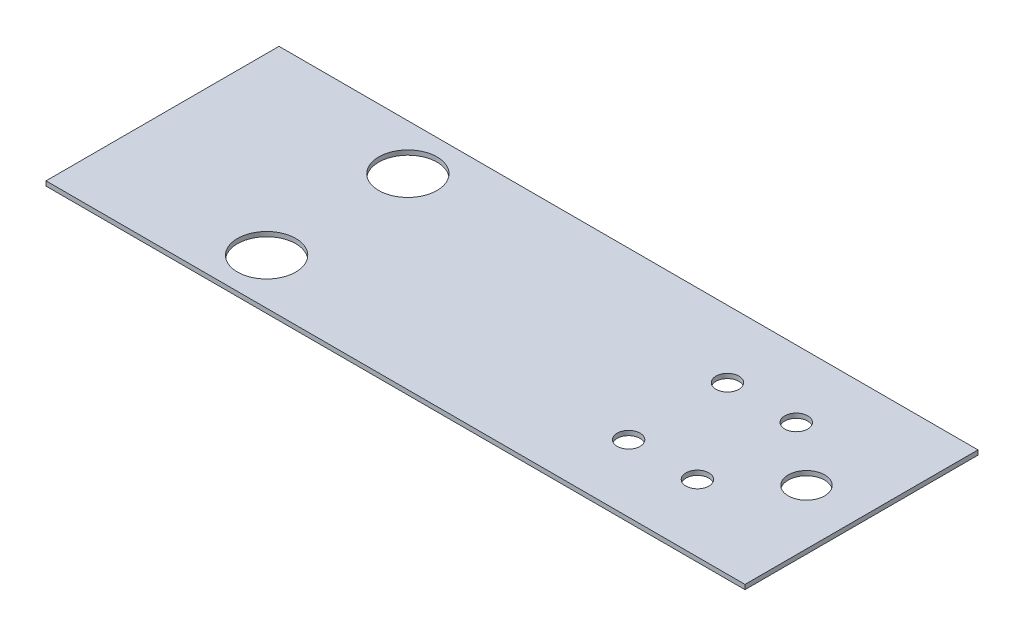
ISO-10303-21;
HEADER;
FILE_DESCRIPTION(('STEP AP214'),'2;1');
FILE_NAME('part.step','',(''),(''),'','','');
FILE_SCHEMA(('AUTOMOTIVE_DESIGN { 1 0 10303 214 1 1 1 1 }'));
ENDSEC;
DATA;
#1=APPLICATION_CONTEXT('core data for automotive mechanical design processes');
#2=APPLICATION_PROTOCOL_DEFINITION('international standard','automotive_design',2000,#1);
#3=PRODUCT_CONTEXT('',#1,'mechanical');
#4=PRODUCT('Part','Part','',(#3));
#5=PRODUCT_RELATED_PRODUCT_CATEGORY('part','',(#4));
#6=PRODUCT_DEFINITION_FORMATION('','',#4);
#7=PRODUCT_DEFINITION_CONTEXT('part definition',#1,'design');
#8=PRODUCT_DEFINITION('design','',#6,#7);
#9=PRODUCT_DEFINITION_SHAPE('','',#8);
#10=(LENGTH_UNIT() NAMED_UNIT(*) SI_UNIT(.MILLI.,.METRE.));
#11=(NAMED_UNIT(*) PLANE_ANGLE_UNIT() SI_UNIT($,.RADIAN.));
#12=(NAMED_UNIT(*) SI_UNIT($,.STERADIAN.) SOLID_ANGLE_UNIT());
#13=UNCERTAINTY_MEASURE_WITH_UNIT(LENGTH_MEASURE(1.E-05),#10,'distance_accuracy_value','');
#14=(GEOMETRIC_REPRESENTATION_CONTEXT(3) GLOBAL_UNCERTAINTY_ASSIGNED_CONTEXT((#13)) GLOBAL_UNIT_ASSIGNED_CONTEXT((#10,
#11,#12)) REPRESENTATION_CONTEXT('',''));
#15=CARTESIAN_POINT('',(0.,0.,0.));
#16=DIRECTION('',(0.,0.,1.));
#17=DIRECTION('',(1.,0.,0.));
#18=AXIS2_PLACEMENT_3D('',#15,#16,#17);
#19=CARTESIAN_POINT('',(-76.2,1.,25.4));
#20=DIRECTION('',(1.,0.,0.));
#21=DIRECTION('',(0.,0.,-1.));
#22=AXIS2_PLACEMENT_3D('',#19,#20,#21);
#23=PLANE('',#22);
#24=DIRECTION('',(0.,0.,1.));
#25=VECTOR('',#24,1.);
#26=CARTESIAN_POINT('',(-76.2,0.,25.4));
#27=LINE('',#26,#25);
#28=CARTESIAN_POINT('',(-76.2,0.,-25.4));
#29=VERTEX_POINT('',#28);
#30=CARTESIAN_POINT('',(-76.2,0.,25.4));
#31=VERTEX_POINT('',#30);
#32=EDGE_CURVE('E96',#29,#31,#27,.T.);
#33=ORIENTED_EDGE('',*,*,#32,.T.);
#34=DIRECTION('',(0.,-1.,0.));
#35=VECTOR('',#34,1.);
#36=CARTESIAN_POINT('',(-76.2,1.,25.4));
#37=LINE('',#36,#35);
#38=CARTESIAN_POINT('',(-76.2,1.,25.4));
#39=VERTEX_POINT('',#38);
#40=EDGE_CURVE('E11',#39,#31,#37,.T.);
#41=ORIENTED_EDGE('',*,*,#40,.F.);
#42=DIRECTION('',(0.,0.,1.));
#43=VECTOR('',#42,1.);
#44=CARTESIAN_POINT('',(-76.2,1.,25.4));
#45=LINE('',#44,#43);
#46=CARTESIAN_POINT('',(-76.2,1.,-25.4));
#47=VERTEX_POINT('',#46);
#48=EDGE_CURVE('E84',#47,#39,#45,.T.);
#49=ORIENTED_EDGE('',*,*,#48,.F.);
#50=DIRECTION('',(0.,-1.,0.));
#51=VECTOR('',#50,1.);
#52=CARTESIAN_POINT('',(-76.2,1.,-25.4));
#53=LINE('',#52,#51);
#54=EDGE_CURVE('E92',#47,#29,#53,.T.);
#55=ORIENTED_EDGE('',*,*,#54,.T.);
#56=EDGE_LOOP('',(#33,#41,#49,#55));
#57=FACE_BOUND('',#56,.T.);
#58=ADVANCED_FACE('F33',(#57),#23,.F.);
#59=CARTESIAN_POINT('',(76.2,1.,25.4));
#60=DIRECTION('',(0.,0.,-1.));
#61=DIRECTION('',(-1.,0.,0.));
#62=AXIS2_PLACEMENT_3D('',#59,#60,#61);
#63=PLANE('',#62);
#64=DIRECTION('',(1.,0.,0.));
#65=VECTOR('',#64,1.);
#66=CARTESIAN_POINT('',(76.2,0.,25.4));
#67=LINE('',#66,#65);
#68=CARTESIAN_POINT('',(76.2,0.,25.4));
#69=VERTEX_POINT('',#68);
#70=EDGE_CURVE('E88',#31,#69,#67,.T.);
#71=ORIENTED_EDGE('',*,*,#70,.T.);
#72=DIRECTION('',(0.,-1.,0.));
#73=VECTOR('',#72,1.);
#74=CARTESIAN_POINT('',(76.2,1.,25.4));
#75=LINE('',#74,#73);
#76=CARTESIAN_POINT('',(76.2,1.,25.4));
#77=VERTEX_POINT('',#76);
#78=EDGE_CURVE('E41',#77,#69,#75,.T.);
#79=ORIENTED_EDGE('',*,*,#78,.F.);
#80=DIRECTION('',(1.,0.,0.));
#81=VECTOR('',#80,1.);
#82=CARTESIAN_POINT('',(76.2,1.,25.4));
#83=LINE('',#82,#81);
#84=EDGE_CURVE('E79',#39,#77,#83,.T.);
#85=ORIENTED_EDGE('',*,*,#84,.F.);
#86=ORIENTED_EDGE('',*,*,#40,.T.);
#87=EDGE_LOOP('',(#71,#79,#85,#86));
#88=FACE_BOUND('',#87,.T.);
#89=ADVANCED_FACE('F87',(#88),#63,.F.);
#90=CARTESIAN_POINT('',(76.2,1.,25.4));
#91=DIRECTION('',(-1.,0.,0.));
#92=DIRECTION('',(0.,0.,1.));
#93=AXIS2_PLACEMENT_3D('',#90,#91,#92);
#94=PLANE('',#93);
#95=DIRECTION('',(0.,0.,-1.));
#96=VECTOR('',#95,1.);
#97=CARTESIAN_POINT('',(76.2,0.,25.4));
#98=LINE('',#97,#96);
#99=CARTESIAN_POINT('',(76.2,0.,-25.4));
#100=VERTEX_POINT('',#99);
#101=EDGE_CURVE('E66',#69,#100,#98,.T.);
#102=ORIENTED_EDGE('',*,*,#101,.T.);
#103=DIRECTION('',(0.,-1.,0.));
#104=VECTOR('',#103,1.);
#105=CARTESIAN_POINT('',(76.2,1.,-25.4));
#106=LINE('',#105,#104);
#107=CARTESIAN_POINT('',(76.2,1.,-25.4));
#108=VERTEX_POINT('',#107);
#109=EDGE_CURVE('E89',#108,#100,#106,.T.);
#110=ORIENTED_EDGE('',*,*,#109,.F.);
#111=DIRECTION('',(0.,0.,-1.));
#112=VECTOR('',#111,1.);
#113=CARTESIAN_POINT('',(76.2,1.,25.4));
#114=LINE('',#113,#112);
#115=EDGE_CURVE('E82',#77,#108,#114,.T.);
#116=ORIENTED_EDGE('',*,*,#115,.F.);
#117=ORIENTED_EDGE('',*,*,#78,.T.);
#118=EDGE_LOOP('',(#102,#110,#116,#117));
#119=FACE_BOUND('',#118,.T.);
#120=ADVANCED_FACE('F90',(#119),#94,.F.);
#121=CARTESIAN_POINT('',(76.2,1.,-25.4));
#122=DIRECTION('',(0.,0.,1.));
#123=DIRECTION('',(1.,0.,0.));
#124=AXIS2_PLACEMENT_3D('',#121,#122,#123);
#125=PLANE('',#124);
#126=DIRECTION('',(-1.,0.,0.));
#127=VECTOR('',#126,1.);
#128=CARTESIAN_POINT('',(76.2,0.,-25.4));
#129=LINE('',#128,#127);
#130=EDGE_CURVE('E72',#100,#29,#129,.T.);
#131=ORIENTED_EDGE('',*,*,#130,.T.);
#132=ORIENTED_EDGE('',*,*,#54,.F.);
#133=DIRECTION('',(-1.,0.,0.));
#134=VECTOR('',#133,1.);
#135=CARTESIAN_POINT('',(76.2,1.,-25.4));
#136=LINE('',#135,#134);
#137=EDGE_CURVE('E49',#108,#47,#136,.T.);
#138=ORIENTED_EDGE('',*,*,#137,.F.);
#139=ORIENTED_EDGE('',*,*,#109,.T.);
#140=EDGE_LOOP('',(#131,#132,#138,#139));
#141=FACE_BOUND('',#140,.T.);
#142=ADVANCED_FACE('F104',(#141),#125,.F.);
#143=CARTESIAN_POINT('',(0.,1.,0.));
#144=DIRECTION('',(0.,1.,0.));
#145=DIRECTION('',(0.,0.,1.));
#146=AXIS2_PLACEMENT_3D('',#143,#144,#145);
#147=PLANE('',#146);
#148=CARTESIAN_POINT('',(64.2,1.,0.));
#149=DIRECTION('',(0.,1.,0.));
#150=DIRECTION('',(0.,0.,1.));
#151=AXIS2_PLACEMENT_3D('',#148,#149,#150);
#152=CIRCLE('',#151,3.96874999999999);
#153=CARTESIAN_POINT('',(64.2,1.,3.96874999999999));
#154=VERTEX_POINT('',#153);
#155=EDGE_CURVE('E146',#154,#154,#152,.T.);
#156=ORIENTED_EDGE('',*,*,#155,.F.);
#157=EDGE_LOOP('',(#156));
#158=FACE_BOUND('',#157,.T.);
#159=CARTESIAN_POINT('',(51.2,1.,10.775));
#160=DIRECTION('',(0.,1.,0.));
#161=DIRECTION('',(0.,0.,-1.));
#162=AXIS2_PLACEMENT_3D('',#159,#160,#161);
#163=CIRCLE('',#162,2.50000000000001);
#164=CARTESIAN_POINT('',(51.2,1.,8.275));
#165=VERTEX_POINT('',#164);
#166=EDGE_CURVE('E128',#165,#165,#163,.T.);
#167=ORIENTED_EDGE('',*,*,#166,.F.);
#168=EDGE_LOOP('',(#167));
#169=FACE_BOUND('',#168,.T.);
#170=CARTESIAN_POINT('',(36.2,1.,10.775));
#171=DIRECTION('',(0.,1.,0.));
#172=DIRECTION('',(0.,0.,-1.));
#173=AXIS2_PLACEMENT_3D('',#170,#171,#172);
#174=CIRCLE('',#173,2.5);
#175=CARTESIAN_POINT('',(36.2,1.,8.27500000000001));
#176=VERTEX_POINT('',#175);
#177=EDGE_CURVE('E135',#176,#176,#174,.T.);
#178=ORIENTED_EDGE('',*,*,#177,.F.);
#179=EDGE_LOOP('',(#178));
#180=FACE_BOUND('',#179,.T.);
#181=CARTESIAN_POINT('',(36.2,1.,-10.775));
#182=DIRECTION('',(0.,1.,0.));
#183=DIRECTION('',(0.,0.,1.));
#184=AXIS2_PLACEMENT_3D('',#181,#182,#183);
#185=CIRCLE('',#184,2.5);
#186=CARTESIAN_POINT('',(36.2,1.,-8.27500000000001));
#187=VERTEX_POINT('',#186);
#188=EDGE_CURVE('E141',#187,#187,#185,.T.);
#189=ORIENTED_EDGE('',*,*,#188,.F.);
#190=EDGE_LOOP('',(#189));
#191=FACE_BOUND('',#190,.T.);
#192=CARTESIAN_POINT('',(51.2,1.,-10.775));
#193=DIRECTION('',(0.,1.,0.));
#194=DIRECTION('',(0.,0.,1.));
#195=AXIS2_PLACEMENT_3D('',#192,#193,#194);
#196=CIRCLE('',#195,2.50000000000001);
#197=CARTESIAN_POINT('',(51.2,1.,-8.275));
#198=VERTEX_POINT('',#197);
#199=EDGE_CURVE('E122',#198,#198,#196,.T.);
#200=ORIENTED_EDGE('',*,*,#199,.F.);
#201=EDGE_LOOP('',(#200));
#202=FACE_BOUND('',#201,.T.);
#203=CARTESIAN_POINT('',(-38.1,1.,-15.4));
#204=DIRECTION('',(0.,1.,0.));
#205=DIRECTION('',(0.,0.,1.));
#206=AXIS2_PLACEMENT_3D('',#203,#204,#205);
#207=CIRCLE('',#206,6.35);
#208=CARTESIAN_POINT('',(-38.1,1.,-9.05000000000001));
#209=VERTEX_POINT('',#208);
#210=EDGE_CURVE('E117',#209,#209,#207,.T.);
#211=ORIENTED_EDGE('',*,*,#210,.F.);
#212=EDGE_LOOP('',(#211));
#213=FACE_BOUND('',#212,.T.);
#214=CARTESIAN_POINT('',(-38.1,1.,15.4));
#215=DIRECTION('',(0.,1.,0.));
#216=DIRECTION('',(0.,0.,-1.));
#217=AXIS2_PLACEMENT_3D('',#214,#215,#216);
#218=CIRCLE('',#217,6.35);
#219=CARTESIAN_POINT('',(-38.1,1.,9.05000000000001));
#220=VERTEX_POINT('',#219);
#221=EDGE_CURVE('E110',#220,#220,#218,.T.);
#222=ORIENTED_EDGE('',*,*,#221,.F.);
#223=EDGE_LOOP('',(#222));
#224=FACE_BOUND('',#223,.T.);
#225=ORIENTED_EDGE('',*,*,#48,.T.);
#226=ORIENTED_EDGE('',*,*,#84,.T.);
#227=ORIENTED_EDGE('',*,*,#115,.T.);
#228=ORIENTED_EDGE('',*,*,#137,.T.);
#229=EDGE_LOOP('',(#225,#226,#227,#228));
#230=FACE_BOUND('',#229,.T.);
#231=ADVANCED_FACE('F80',(#158,#169,#180,#191,#202,#213,#224,#230),#147,.T.);
#232=CARTESIAN_POINT('',(0.,0.,0.));
#233=DIRECTION('',(0.,1.,0.));
#234=DIRECTION('',(0.,0.,1.));
#235=AXIS2_PLACEMENT_3D('',#232,#233,#234);
#236=PLANE('',#235);
#237=CARTESIAN_POINT('',(64.2,0.,0.));
#238=DIRECTION('',(0.,1.,0.));
#239=DIRECTION('',(0.,0.,1.));
#240=AXIS2_PLACEMENT_3D('',#237,#238,#239);
#241=CIRCLE('',#240,3.96874999999999);
#242=CARTESIAN_POINT('',(64.2,0.,3.96874999999999));
#243=VERTEX_POINT('',#242);
#244=EDGE_CURVE('E132',#243,#243,#241,.T.);
#245=ORIENTED_EDGE('',*,*,#244,.T.);
#246=EDGE_LOOP('',(#245));
#247=FACE_BOUND('',#246,.T.);
#248=CARTESIAN_POINT('',(51.2,0.,10.775));
#249=DIRECTION('',(0.,1.,0.));
#250=DIRECTION('',(0.,0.,-1.));
#251=AXIS2_PLACEMENT_3D('',#248,#249,#250);
#252=CIRCLE('',#251,2.50000000000001);
#253=CARTESIAN_POINT('',(51.2,0.,8.275));
#254=VERTEX_POINT('',#253);
#255=EDGE_CURVE('E131',#254,#254,#252,.T.);
#256=ORIENTED_EDGE('',*,*,#255,.T.);
#257=EDGE_LOOP('',(#256));
#258=FACE_BOUND('',#257,.T.);
#259=CARTESIAN_POINT('',(36.2,0.,10.775));
#260=DIRECTION('',(0.,1.,0.));
#261=DIRECTION('',(0.,0.,-1.));
#262=AXIS2_PLACEMENT_3D('',#259,#260,#261);
#263=CIRCLE('',#262,2.5);
#264=CARTESIAN_POINT('',(36.2,0.,8.27500000000001));
#265=VERTEX_POINT('',#264);
#266=EDGE_CURVE('E138',#265,#265,#263,.T.);
#267=ORIENTED_EDGE('',*,*,#266,.T.);
#268=EDGE_LOOP('',(#267));
#269=FACE_BOUND('',#268,.T.);
#270=CARTESIAN_POINT('',(36.2,0.,-10.775));
#271=DIRECTION('',(0.,1.,0.));
#272=DIRECTION('',(0.,0.,1.));
#273=AXIS2_PLACEMENT_3D('',#270,#271,#272);
#274=CIRCLE('',#273,2.5);
#275=CARTESIAN_POINT('',(36.2,0.,-8.27500000000001));
#276=VERTEX_POINT('',#275);
#277=EDGE_CURVE('E125',#276,#276,#274,.T.);
#278=ORIENTED_EDGE('',*,*,#277,.T.);
#279=EDGE_LOOP('',(#278));
#280=FACE_BOUND('',#279,.T.);
#281=CARTESIAN_POINT('',(51.2,0.,-10.775));
#282=DIRECTION('',(0.,1.,0.));
#283=DIRECTION('',(0.,0.,1.));
#284=AXIS2_PLACEMENT_3D('',#281,#282,#283);
#285=CIRCLE('',#284,2.50000000000001);
#286=CARTESIAN_POINT('',(51.2,0.,-8.275));
#287=VERTEX_POINT('',#286);
#288=EDGE_CURVE('E114',#287,#287,#285,.T.);
#289=ORIENTED_EDGE('',*,*,#288,.T.);
#290=EDGE_LOOP('',(#289));
#291=FACE_BOUND('',#290,.T.);
#292=CARTESIAN_POINT('',(-38.1,0.,-15.4));
#293=DIRECTION('',(0.,1.,0.));
#294=DIRECTION('',(0.,0.,1.));
#295=AXIS2_PLACEMENT_3D('',#292,#293,#294);
#296=CIRCLE('',#295,6.35);
#297=CARTESIAN_POINT('',(-38.1,0.,-9.05000000000001));
#298=VERTEX_POINT('',#297);
#299=EDGE_CURVE('E99',#298,#298,#296,.T.);
#300=ORIENTED_EDGE('',*,*,#299,.T.);
#301=EDGE_LOOP('',(#300));
#302=FACE_BOUND('',#301,.T.);
#303=CARTESIAN_POINT('',(-38.1,0.,15.4));
#304=DIRECTION('',(0.,1.,0.));
#305=DIRECTION('',(0.,0.,-1.));
#306=AXIS2_PLACEMENT_3D('',#303,#304,#305);
#307=CIRCLE('',#306,6.35);
#308=CARTESIAN_POINT('',(-38.1,0.,9.05000000000001));
#309=VERTEX_POINT('',#308);
#310=EDGE_CURVE('E113',#309,#309,#307,.T.);
#311=ORIENTED_EDGE('',*,*,#310,.T.);
#312=EDGE_LOOP('',(#311));
#313=FACE_BOUND('',#312,.T.);
#314=ORIENTED_EDGE('',*,*,#32,.F.);
#315=ORIENTED_EDGE('',*,*,#130,.F.);
#316=ORIENTED_EDGE('',*,*,#101,.F.);
#317=ORIENTED_EDGE('',*,*,#70,.F.);
#318=EDGE_LOOP('',(#314,#315,#316,#317));
#319=FACE_BOUND('',#318,.T.);
#320=ADVANCED_FACE('F107',(#247,#258,#269,#280,#291,#302,#313,#319),#236,.F.);
#321=CARTESIAN_POINT('',(-38.1,0.,15.4));
#322=DIRECTION('',(0.,1.,0.));
#323=DIRECTION('',(0.,0.,1.));
#324=AXIS2_PLACEMENT_3D('',#321,#322,#323);
#325=CYLINDRICAL_SURFACE('',#324,6.35);
#326=ORIENTED_EDGE('',*,*,#310,.F.);
#327=EDGE_LOOP('',(#326));
#328=FACE_BOUND('',#327,.T.);
#329=ORIENTED_EDGE('',*,*,#221,.T.);
#330=EDGE_LOOP('',(#329));
#331=FACE_BOUND('',#330,.T.);
#332=ADVANCED_FACE('F176',(#328,#331),#325,.F.);
#333=CARTESIAN_POINT('',(-38.1,0.,-15.4));
#334=DIRECTION('',(0.,1.,0.));
#335=DIRECTION('',(0.,0.,1.));
#336=AXIS2_PLACEMENT_3D('',#333,#334,#335);
#337=CYLINDRICAL_SURFACE('',#336,6.35);
#338=ORIENTED_EDGE('',*,*,#299,.F.);
#339=EDGE_LOOP('',(#338));
#340=FACE_BOUND('',#339,.T.);
#341=ORIENTED_EDGE('',*,*,#210,.T.);
#342=EDGE_LOOP('',(#341));
#343=FACE_BOUND('',#342,.T.);
#344=ADVANCED_FACE('F178',(#340,#343),#337,.F.);
#345=CARTESIAN_POINT('',(51.2,0.,-10.775));
#346=DIRECTION('',(0.,1.,0.));
#347=DIRECTION('',(0.,0.,1.));
#348=AXIS2_PLACEMENT_3D('',#345,#346,#347);
#349=CYLINDRICAL_SURFACE('',#348,2.50000000000001);
#350=ORIENTED_EDGE('',*,*,#288,.F.);
#351=EDGE_LOOP('',(#350));
#352=FACE_BOUND('',#351,.T.);
#353=ORIENTED_EDGE('',*,*,#199,.T.);
#354=EDGE_LOOP('',(#353));
#355=FACE_BOUND('',#354,.T.);
#356=ADVANCED_FACE('F185',(#352,#355),#349,.F.);
#357=CARTESIAN_POINT('',(36.2,0.,-10.775));
#358=DIRECTION('',(0.,1.,0.));
#359=DIRECTION('',(0.,0.,1.));
#360=AXIS2_PLACEMENT_3D('',#357,#358,#359);
#361=CYLINDRICAL_SURFACE('',#360,2.5);
#362=ORIENTED_EDGE('',*,*,#277,.F.);
#363=EDGE_LOOP('',(#362));
#364=FACE_BOUND('',#363,.T.);
#365=ORIENTED_EDGE('',*,*,#188,.T.);
#366=EDGE_LOOP('',(#365));
#367=FACE_BOUND('',#366,.T.);
#368=ADVANCED_FACE('F237',(#364,#367),#361,.F.);
#369=CARTESIAN_POINT('',(36.2,0.,10.775));
#370=DIRECTION('',(0.,1.,0.));
#371=DIRECTION('',(0.,0.,1.));
#372=AXIS2_PLACEMENT_3D('',#369,#370,#371);
#373=CYLINDRICAL_SURFACE('',#372,2.5);
#374=ORIENTED_EDGE('',*,*,#266,.F.);
#375=EDGE_LOOP('',(#374));
#376=FACE_BOUND('',#375,.T.);
#377=ORIENTED_EDGE('',*,*,#177,.T.);
#378=EDGE_LOOP('',(#377));
#379=FACE_BOUND('',#378,.T.);
#380=ADVANCED_FACE('F230',(#376,#379),#373,.F.);
#381=CARTESIAN_POINT('',(51.2,0.,10.775));
#382=DIRECTION('',(0.,1.,0.));
#383=DIRECTION('',(0.,0.,1.));
#384=AXIS2_PLACEMENT_3D('',#381,#382,#383);
#385=CYLINDRICAL_SURFACE('',#384,2.50000000000001);
#386=ORIENTED_EDGE('',*,*,#255,.F.);
#387=EDGE_LOOP('',(#386));
#388=FACE_BOUND('',#387,.T.);
#389=ORIENTED_EDGE('',*,*,#166,.T.);
#390=EDGE_LOOP('',(#389));
#391=FACE_BOUND('',#390,.T.);
#392=ADVANCED_FACE('F157',(#388,#391),#385,.F.);
#393=CARTESIAN_POINT('',(64.2,0.,0.));
#394=DIRECTION('',(0.,1.,0.));
#395=DIRECTION('',(0.,0.,1.));
#396=AXIS2_PLACEMENT_3D('',#393,#394,#395);
#397=CYLINDRICAL_SURFACE('',#396,3.96874999999999);
#398=ORIENTED_EDGE('',*,*,#244,.F.);
#399=EDGE_LOOP('',(#398));
#400=FACE_BOUND('',#399,.T.);
#401=ORIENTED_EDGE('',*,*,#155,.T.);
#402=EDGE_LOOP('',(#401));
#403=FACE_BOUND('',#402,.T.);
#404=ADVANCED_FACE('F154',(#400,#403),#397,.F.);
#405=CLOSED_SHELL('',(#58,#89,#120,#142,#231,#320,#332,#344,#356,#368,#380,#392,#404));
#406=MANIFOLD_SOLID_BREP('B2',#405);
#407=ADVANCED_BREP_SHAPE_REPRESENTATION('',(#18,#406),#14);
#408=SHAPE_DEFINITION_REPRESENTATION(#9,#407);
ENDSEC;
END-ISO-10303-21;
